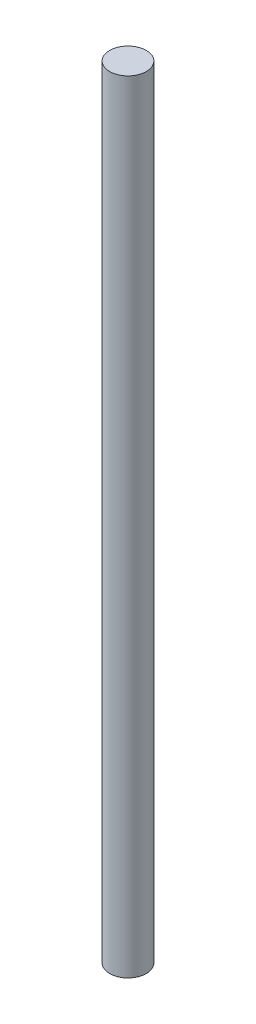
ISO-10303-21;
HEADER;
FILE_DESCRIPTION(('STEP AP214'),'2;1');
FILE_NAME('part.step','',(''),(''),'','','');
FILE_SCHEMA(('AUTOMOTIVE_DESIGN { 1 0 10303 214 1 1 1 1 }'));
ENDSEC;
DATA;
#1=APPLICATION_CONTEXT('core data for automotive mechanical design processes');
#2=APPLICATION_PROTOCOL_DEFINITION('international standard','automotive_design',2000,#1);
#3=PRODUCT_CONTEXT('',#1,'mechanical');
#4=PRODUCT('Part','Part','',(#3));
#5=PRODUCT_RELATED_PRODUCT_CATEGORY('part','',(#4));
#6=PRODUCT_DEFINITION_FORMATION('','',#4);
#7=PRODUCT_DEFINITION_CONTEXT('part definition',#1,'design');
#8=PRODUCT_DEFINITION('design','',#6,#7);
#9=PRODUCT_DEFINITION_SHAPE('','',#8);
#10=(LENGTH_UNIT() NAMED_UNIT(*) SI_UNIT(.MILLI.,.METRE.));
#11=(NAMED_UNIT(*) PLANE_ANGLE_UNIT() SI_UNIT($,.RADIAN.));
#12=(NAMED_UNIT(*) SI_UNIT($,.STERADIAN.) SOLID_ANGLE_UNIT());
#13=UNCERTAINTY_MEASURE_WITH_UNIT(LENGTH_MEASURE(1.E-05),#10,'distance_accuracy_value','');
#14=(GEOMETRIC_REPRESENTATION_CONTEXT(3) GLOBAL_UNCERTAINTY_ASSIGNED_CONTEXT((#13)) GLOBAL_UNIT_ASSIGNED_CONTEXT((#10,
#11,#12)) REPRESENTATION_CONTEXT('',''));
#15=CARTESIAN_POINT('',(0.,0.,0.));
#16=DIRECTION('',(0.,0.,1.));
#17=DIRECTION('',(1.,0.,0.));
#18=AXIS2_PLACEMENT_3D('',#15,#16,#17);
#19=CARTESIAN_POINT('',(0.,203.2,0.));
#20=DIRECTION('',(0.,-1.,0.));
#21=DIRECTION('',(0.,0.,-1.));
#22=AXIS2_PLACEMENT_3D('',#19,#20,#21);
#23=CYLINDRICAL_SURFACE('',#22,4.7625);
#24=CARTESIAN_POINT('',(0.,203.2,0.));
#25=DIRECTION('',(0.,1.,0.));
#26=DIRECTION('',(0.,0.,1.));
#27=AXIS2_PLACEMENT_3D('',#24,#25,#26);
#28=CIRCLE('',#27,4.7625);
#29=CARTESIAN_POINT('',(0.,203.2,4.7625));
#30=VERTEX_POINT('',#29);
#31=EDGE_CURVE('E10',#30,#30,#28,.T.);
#32=ORIENTED_EDGE('',*,*,#31,.F.);
#33=EDGE_LOOP('',(#32));
#34=FACE_BOUND('',#33,.T.);
#35=CARTESIAN_POINT('',(0.,0.,0.));
#36=DIRECTION('',(0.,1.,0.));
#37=DIRECTION('',(0.,0.,1.));
#38=AXIS2_PLACEMENT_3D('',#35,#36,#37);
#39=CIRCLE('',#38,4.7625);
#40=CARTESIAN_POINT('',(0.,0.,4.7625));
#41=VERTEX_POINT('',#40);
#42=EDGE_CURVE('E34',#41,#41,#39,.T.);
#43=ORIENTED_EDGE('',*,*,#42,.T.);
#44=EDGE_LOOP('',(#43));
#45=FACE_BOUND('',#44,.T.);
#46=ADVANCED_FACE('F31',(#34,#45),#23,.T.);
#47=CARTESIAN_POINT('',(0.,203.2,0.));
#48=DIRECTION('',(0.,1.,0.));
#49=DIRECTION('',(0.,0.,1.));
#50=AXIS2_PLACEMENT_3D('',#47,#48,#49);
#51=PLANE('',#50);
#52=ORIENTED_EDGE('',*,*,#31,.T.);
#53=EDGE_LOOP('',(#52));
#54=FACE_BOUND('',#53,.T.);
#55=ADVANCED_FACE('F46',(#54),#51,.T.);
#56=CARTESIAN_POINT('',(0.,0.,0.));
#57=DIRECTION('',(0.,1.,0.));
#58=DIRECTION('',(0.,0.,1.));
#59=AXIS2_PLACEMENT_3D('',#56,#57,#58);
#60=PLANE('',#59);
#61=ORIENTED_EDGE('',*,*,#42,.F.);
#62=EDGE_LOOP('',(#61));
#63=FACE_BOUND('',#62,.T.);
#64=ADVANCED_FACE('F44',(#63),#60,.F.);
#65=CLOSED_SHELL('',(#46,#55,#64));
#66=MANIFOLD_SOLID_BREP('B2',#65);
#67=ADVANCED_BREP_SHAPE_REPRESENTATION('',(#18,#66),#14);
#68=SHAPE_DEFINITION_REPRESENTATION(#9,#67);
ENDSEC;
END-ISO-10303-21;
